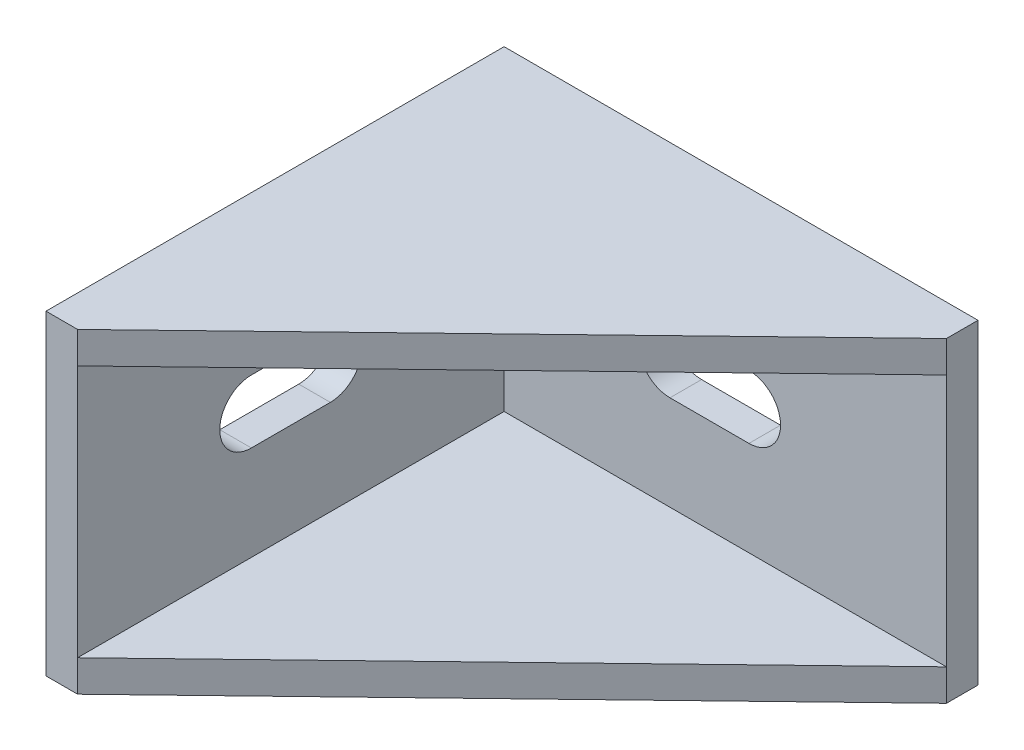
ISO-10303-21;
HEADER;
FILE_DESCRIPTION(('STEP AP214'),'2;1');
FILE_NAME('part.step','',(''),(''),'','','');
FILE_SCHEMA(('AUTOMOTIVE_DESIGN { 1 0 10303 214 1 1 1 1 }'));
ENDSEC;
DATA;
#1=APPLICATION_CONTEXT('core data for automotive mechanical design processes');
#2=APPLICATION_PROTOCOL_DEFINITION('international standard','automotive_design',2000,#1);
#3=PRODUCT_CONTEXT('',#1,'mechanical');
#4=PRODUCT('Part','Part','',(#3));
#5=PRODUCT_RELATED_PRODUCT_CATEGORY('part','',(#4));
#6=PRODUCT_DEFINITION_FORMATION('','',#4);
#7=PRODUCT_DEFINITION_CONTEXT('part definition',#1,'design');
#8=PRODUCT_DEFINITION('design','',#6,#7);
#9=PRODUCT_DEFINITION_SHAPE('','',#8);
#10=(LENGTH_UNIT() NAMED_UNIT(*) SI_UNIT(.MILLI.,.METRE.));
#11=(NAMED_UNIT(*) PLANE_ANGLE_UNIT() SI_UNIT($,.RADIAN.));
#12=(NAMED_UNIT(*) SI_UNIT($,.STERADIAN.) SOLID_ANGLE_UNIT());
#13=UNCERTAINTY_MEASURE_WITH_UNIT(LENGTH_MEASURE(1.E-05),#10,'distance_accuracy_value','');
#14=(GEOMETRIC_REPRESENTATION_CONTEXT(3) GLOBAL_UNCERTAINTY_ASSIGNED_CONTEXT((#13)) GLOBAL_UNIT_ASSIGNED_CONTEXT((#10,
#11,#12)) REPRESENTATION_CONTEXT('',''));
#15=CARTESIAN_POINT('',(0.,0.,0.));
#16=DIRECTION('',(0.,0.,1.));
#17=DIRECTION('',(1.,0.,0.));
#18=AXIS2_PLACEMENT_3D('',#15,#16,#17);
#19=CARTESIAN_POINT('',(0.,0.,0.));
#20=DIRECTION('',(0.,0.,-1.));
#21=DIRECTION('',(-1.,0.,0.));
#22=AXIS2_PLACEMENT_3D('',#19,#20,#21);
#23=PLANE('',#22);
#24=CARTESIAN_POINT('',(-2.5,0.,0.));
#25=DIRECTION('',(0.,0.,-1.));
#26=DIRECTION('',(-1.,0.,0.));
#27=AXIS2_PLACEMENT_3D('',#24,#25,#26);
#28=CIRCLE('',#27,2.);
#29=CARTESIAN_POINT('',(-2.5,-2.,0.));
#30=VERTEX_POINT('',#29);
#31=CARTESIAN_POINT('',(-2.5,2.,0.));
#32=VERTEX_POINT('',#31);
#33=EDGE_CURVE('E397',#30,#32,#28,.T.);
#34=ORIENTED_EDGE('',*,*,#33,.F.);
#35=DIRECTION('',(-1.,0.,0.));
#36=VECTOR('',#35,1.);
#37=CARTESIAN_POINT('',(0.,-2.,0.));
#38=LINE('',#37,#36);
#39=CARTESIAN_POINT('',(2.5,-2.,0.));
#40=VERTEX_POINT('',#39);
#41=EDGE_CURVE('E390',#40,#30,#38,.T.);
#42=ORIENTED_EDGE('',*,*,#41,.F.);
#43=CARTESIAN_POINT('',(2.5,0.,0.));
#44=DIRECTION('',(0.,0.,-1.));
#45=DIRECTION('',(-1.,0.,0.));
#46=AXIS2_PLACEMENT_3D('',#43,#44,#45);
#47=CIRCLE('',#46,2.);
#48=CARTESIAN_POINT('',(2.5,2.,0.));
#49=VERTEX_POINT('',#48);
#50=EDGE_CURVE('E392',#49,#40,#47,.T.);
#51=ORIENTED_EDGE('',*,*,#50,.F.);
#52=DIRECTION('',(1.,0.,0.));
#53=VECTOR('',#52,1.);
#54=CARTESIAN_POINT('',(0.,2.,0.));
#55=LINE('',#54,#53);
#56=EDGE_CURVE('E395',#32,#49,#55,.T.);
#57=ORIENTED_EDGE('',*,*,#56,.F.);
#58=EDGE_LOOP('',(#34,#42,#51,#57));
#59=FACE_BOUND('',#58,.T.);
#60=DIRECTION('',(0.,1.,0.));
#61=VECTOR('',#60,1.);
#62=CARTESIAN_POINT('',(15.,-10.,0.));
#63=LINE('',#62,#61);
#64=CARTESIAN_POINT('',(15.,-10.,0.));
#65=VERTEX_POINT('',#64);
#66=CARTESIAN_POINT('',(15.,10.,0.));
#67=VERTEX_POINT('',#66);
#68=EDGE_CURVE('E364',#65,#67,#63,.T.);
#69=ORIENTED_EDGE('',*,*,#68,.F.);
#70=DIRECTION('',(1.,0.,0.));
#71=VECTOR('',#70,1.);
#72=CARTESIAN_POINT('',(-15.,-10.,0.));
#73=LINE('',#72,#71);
#74=CARTESIAN_POINT('',(-15.,-10.,0.));
#75=VERTEX_POINT('',#74);
#76=EDGE_CURVE('E377',#75,#65,#73,.T.);
#77=ORIENTED_EDGE('',*,*,#76,.F.);
#78=DIRECTION('',(0.,-1.,0.));
#79=VECTOR('',#78,1.);
#80=CARTESIAN_POINT('',(-15.,-10.,0.));
#81=LINE('',#80,#79);
#82=CARTESIAN_POINT('',(-15.,10.,0.));
#83=VERTEX_POINT('',#82);
#84=EDGE_CURVE('E375',#83,#75,#81,.T.);
#85=ORIENTED_EDGE('',*,*,#84,.F.);
#86=DIRECTION('',(-1.,0.,0.));
#87=VECTOR('',#86,1.);
#88=CARTESIAN_POINT('',(-15.,10.,0.));
#89=LINE('',#88,#87);
#90=EDGE_CURVE('E373',#67,#83,#89,.T.);
#91=ORIENTED_EDGE('',*,*,#90,.F.);
#92=EDGE_LOOP('',(#69,#77,#85,#91));
#93=FACE_BOUND('',#92,.T.);
#94=DIRECTION('',(0.,1.,0.));
#95=VECTOR('',#94,1.);
#96=CARTESIAN_POINT('',(7.75,-1.,0.));
#97=LINE('',#96,#95);
#98=CARTESIAN_POINT('',(7.75,-1.,0.));
#99=VERTEX_POINT('',#98);
#100=CARTESIAN_POINT('',(7.75,1.,0.));
#101=VERTEX_POINT('',#100);
#102=EDGE_CURVE('E254',#99,#101,#97,.T.);
#103=ORIENTED_EDGE('',*,*,#102,.F.);
#104=CARTESIAN_POINT('',(9.75,-1.,0.));
#105=DIRECTION('',(0.,0.,-1.));
#106=DIRECTION('',(-1.,0.,0.));
#107=AXIS2_PLACEMENT_3D('',#104,#105,#106);
#108=CIRCLE('',#107,2.);
#109=CARTESIAN_POINT('',(11.75,-1.,0.));
#110=VERTEX_POINT('',#109);
#111=EDGE_CURVE('E229',#110,#99,#108,.T.);
#112=ORIENTED_EDGE('',*,*,#111,.F.);
#113=DIRECTION('',(0.,-1.,0.));
#114=VECTOR('',#113,1.);
#115=CARTESIAN_POINT('',(11.75,-1.,0.));
#116=LINE('',#115,#114);
#117=CARTESIAN_POINT('',(11.75,0.999999999999999,0.));
#118=VERTEX_POINT('',#117);
#119=EDGE_CURVE('E260',#118,#110,#116,.T.);
#120=ORIENTED_EDGE('',*,*,#119,.F.);
#121=CARTESIAN_POINT('',(9.75,1.,0.));
#122=DIRECTION('',(0.,0.,-1.));
#123=DIRECTION('',(-1.,0.,0.));
#124=AXIS2_PLACEMENT_3D('',#121,#122,#123);
#125=CIRCLE('',#124,2.);
#126=EDGE_CURVE('E257',#101,#118,#125,.T.);
#127=ORIENTED_EDGE('',*,*,#126,.F.);
#128=EDGE_LOOP('',(#103,#112,#120,#127));
#129=FACE_BOUND('',#128,.T.);
#130=DIRECTION('',(0.,1.,0.));
#131=VECTOR('',#130,1.);
#132=CARTESIAN_POINT('',(-11.75,-1.,0.));
#133=LINE('',#132,#131);
#134=CARTESIAN_POINT('',(-11.75,-1.,0.));
#135=VERTEX_POINT('',#134);
#136=CARTESIAN_POINT('',(-11.75,1.,0.));
#137=VERTEX_POINT('',#136);
#138=EDGE_CURVE('E225',#135,#137,#133,.T.);
#139=ORIENTED_EDGE('',*,*,#138,.F.);
#140=CARTESIAN_POINT('',(-9.75,-1.,0.));
#141=DIRECTION('',(0.,0.,-1.));
#142=DIRECTION('',(-1.,0.,0.));
#143=AXIS2_PLACEMENT_3D('',#140,#141,#142);
#144=CIRCLE('',#143,2.);
#145=CARTESIAN_POINT('',(-7.75,-1.,0.));
#146=VERTEX_POINT('',#145);
#147=EDGE_CURVE('E233',#146,#135,#144,.T.);
#148=ORIENTED_EDGE('',*,*,#147,.F.);
#149=DIRECTION('',(0.,-1.,0.));
#150=VECTOR('',#149,1.);
#151=CARTESIAN_POINT('',(-7.75,-1.,0.));
#152=LINE('',#151,#150);
#153=CARTESIAN_POINT('',(-7.75,1.,0.));
#154=VERTEX_POINT('',#153);
#155=EDGE_CURVE('E244',#154,#146,#152,.T.);
#156=ORIENTED_EDGE('',*,*,#155,.F.);
#157=CARTESIAN_POINT('',(-9.75,1.,0.));
#158=DIRECTION('',(0.,0.,-1.));
#159=DIRECTION('',(-1.,0.,0.));
#160=AXIS2_PLACEMENT_3D('',#157,#158,#159);
#161=CIRCLE('',#160,2.);
#162=EDGE_CURVE('E242',#137,#154,#161,.T.);
#163=ORIENTED_EDGE('',*,*,#162,.F.);
#164=EDGE_LOOP('',(#139,#148,#156,#163));
#165=FACE_BOUND('',#164,.T.);
#166=ADVANCED_FACE('F34',(#59,#93,#129,#165),#23,.T.);
#167=CARTESIAN_POINT('',(0.,0.,2.));
#168=DIRECTION('',(0.,0.,-1.));
#169=DIRECTION('',(-1.,0.,0.));
#170=AXIS2_PLACEMENT_3D('',#167,#168,#169);
#171=PLANE('',#170);
#172=DIRECTION('',(1.,0.,0.));
#173=VECTOR('',#172,1.);
#174=CARTESIAN_POINT('',(-2.5,-2.,2.));
#175=LINE('',#174,#173);
#176=CARTESIAN_POINT('',(-2.5,-2.,2.));
#177=VERTEX_POINT('',#176);
#178=CARTESIAN_POINT('',(2.5,-2.,2.));
#179=VERTEX_POINT('',#178);
#180=EDGE_CURVE('E333',#177,#179,#175,.T.);
#181=ORIENTED_EDGE('',*,*,#180,.F.);
#182=CARTESIAN_POINT('',(-2.5,0.,2.));
#183=DIRECTION('',(0.,0.,1.));
#184=DIRECTION('',(1.,0.,0.));
#185=AXIS2_PLACEMENT_3D('',#182,#183,#184);
#186=CIRCLE('',#185,2.);
#187=CARTESIAN_POINT('',(-2.5,2.,2.));
#188=VERTEX_POINT('',#187);
#189=EDGE_CURVE('E331',#188,#177,#186,.T.);
#190=ORIENTED_EDGE('',*,*,#189,.F.);
#191=DIRECTION('',(-1.,0.,0.));
#192=VECTOR('',#191,1.);
#193=CARTESIAN_POINT('',(-2.5,2.,2.));
#194=LINE('',#193,#192);
#195=CARTESIAN_POINT('',(2.5,2.,2.));
#196=VERTEX_POINT('',#195);
#197=EDGE_CURVE('E339',#196,#188,#194,.T.);
#198=ORIENTED_EDGE('',*,*,#197,.F.);
#199=CARTESIAN_POINT('',(2.5,0.,2.));
#200=DIRECTION('',(0.,0.,1.));
#201=DIRECTION('',(1.,0.,0.));
#202=AXIS2_PLACEMENT_3D('',#199,#200,#201);
#203=CIRCLE('',#202,2.);
#204=EDGE_CURVE('E336',#179,#196,#203,.T.);
#205=ORIENTED_EDGE('',*,*,#204,.F.);
#206=EDGE_LOOP('',(#181,#190,#198,#205));
#207=FACE_BOUND('',#206,.T.);
#208=DIRECTION('',(-1.,0.,0.));
#209=VECTOR('',#208,1.);
#210=CARTESIAN_POINT('',(-13.,8.,2.));
#211=LINE('',#210,#209);
#212=CARTESIAN_POINT('',(15.,8.,2.));
#213=VERTEX_POINT('',#212);
#214=CARTESIAN_POINT('',(-13.,8.,2.));
#215=VERTEX_POINT('',#214);
#216=EDGE_CURVE('E272',#213,#215,#211,.T.);
#217=ORIENTED_EDGE('',*,*,#216,.T.);
#218=DIRECTION('',(0.,-1.,0.));
#219=VECTOR('',#218,1.);
#220=CARTESIAN_POINT('',(-13.,0.,2.));
#221=LINE('',#220,#219);
#222=CARTESIAN_POINT('',(-13.,-8.,2.));
#223=VERTEX_POINT('',#222);
#224=EDGE_CURVE('E345',#215,#223,#221,.T.);
#225=ORIENTED_EDGE('',*,*,#224,.T.);
#226=DIRECTION('',(1.,0.,0.));
#227=VECTOR('',#226,1.);
#228=CARTESIAN_POINT('',(-13.,-8.,2.));
#229=LINE('',#228,#227);
#230=CARTESIAN_POINT('',(15.,-8.,2.));
#231=VERTEX_POINT('',#230);
#232=EDGE_CURVE('E289',#223,#231,#229,.T.);
#233=ORIENTED_EDGE('',*,*,#232,.T.);
#234=DIRECTION('',(0.,1.,0.));
#235=VECTOR('',#234,1.);
#236=CARTESIAN_POINT('',(15.,-10.,2.));
#237=LINE('',#236,#235);
#238=EDGE_CURVE('E370',#231,#213,#237,.T.);
#239=ORIENTED_EDGE('',*,*,#238,.T.);
#240=EDGE_LOOP('',(#217,#225,#233,#239));
#241=FACE_BOUND('',#240,.T.);
#242=ADVANCED_FACE('F477',(#207,#241),#171,.F.);
#243=CARTESIAN_POINT('',(-13.,0.,29.));
#244=DIRECTION('',(1.,0.,0.));
#245=DIRECTION('',(0.,1.,0.));
#246=AXIS2_PLACEMENT_3D('',#243,#244,#245);
#247=PLANE('',#246);
#248=CARTESIAN_POINT('',(-13.,0.,18.));
#249=DIRECTION('',(1.,0.,0.));
#250=DIRECTION('',(0.,1.,0.));
#251=AXIS2_PLACEMENT_3D('',#248,#249,#250);
#252=CIRCLE('',#251,2.);
#253=CARTESIAN_POINT('',(-13.,2.,18.));
#254=VERTEX_POINT('',#253);
#255=CARTESIAN_POINT('',(-13.,-2.,18.));
#256=VERTEX_POINT('',#255);
#257=EDGE_CURVE('E299',#254,#256,#252,.T.);
#258=ORIENTED_EDGE('',*,*,#257,.F.);
#259=DIRECTION('',(0.,0.,1.));
#260=VECTOR('',#259,1.);
#261=CARTESIAN_POINT('',(-13.,2.,18.));
#262=LINE('',#261,#260);
#263=CARTESIAN_POINT('',(-13.,2.,13.));
#264=VERTEX_POINT('',#263);
#265=EDGE_CURVE('E307',#264,#254,#262,.T.);
#266=ORIENTED_EDGE('',*,*,#265,.F.);
#267=CARTESIAN_POINT('',(-13.,0.,13.));
#268=DIRECTION('',(1.,0.,0.));
#269=DIRECTION('',(0.,1.,0.));
#270=AXIS2_PLACEMENT_3D('',#267,#268,#269);
#271=CIRCLE('',#270,2.);
#272=CARTESIAN_POINT('',(-13.,-2.,13.));
#273=VERTEX_POINT('',#272);
#274=EDGE_CURVE('E304',#273,#264,#271,.T.);
#275=ORIENTED_EDGE('',*,*,#274,.F.);
#276=DIRECTION('',(0.,0.,-1.));
#277=VECTOR('',#276,1.);
#278=CARTESIAN_POINT('',(-13.,-2.,18.));
#279=LINE('',#278,#277);
#280=EDGE_CURVE('E301',#256,#273,#279,.T.);
#281=ORIENTED_EDGE('',*,*,#280,.F.);
#282=EDGE_LOOP('',(#258,#266,#275,#281));
#283=FACE_BOUND('',#282,.T.);
#284=ORIENTED_EDGE('',*,*,#224,.F.);
#285=DIRECTION('',(0.,0.,1.));
#286=VECTOR('',#285,1.);
#287=CARTESIAN_POINT('',(-13.,8.,29.));
#288=LINE('',#287,#286);
#289=CARTESIAN_POINT('',(-13.,8.,29.));
#290=VERTEX_POINT('',#289);
#291=EDGE_CURVE('E274',#215,#290,#288,.T.);
#292=ORIENTED_EDGE('',*,*,#291,.T.);
#293=DIRECTION('',(0.,-1.,0.));
#294=VECTOR('',#293,1.);
#295=CARTESIAN_POINT('',(-13.,0.,29.));
#296=LINE('',#295,#294);
#297=CARTESIAN_POINT('',(-13.,-8.,29.));
#298=VERTEX_POINT('',#297);
#299=EDGE_CURVE('E356',#290,#298,#296,.T.);
#300=ORIENTED_EDGE('',*,*,#299,.T.);
#301=DIRECTION('',(0.,0.,-1.));
#302=VECTOR('',#301,1.);
#303=CARTESIAN_POINT('',(-13.,-8.,29.));
#304=LINE('',#303,#302);
#305=EDGE_CURVE('E286',#298,#223,#304,.T.);
#306=ORIENTED_EDGE('',*,*,#305,.T.);
#307=EDGE_LOOP('',(#284,#292,#300,#306));
#308=FACE_BOUND('',#307,.T.);
#309=ADVANCED_FACE('F483',(#283,#308),#247,.T.);
#310=CARTESIAN_POINT('',(15.,-10.,2.));
#311=DIRECTION('',(-1.,0.,0.));
#312=DIRECTION('',(0.,0.,1.));
#313=AXIS2_PLACEMENT_3D('',#310,#311,#312);
#314=PLANE('',#313);
#315=ORIENTED_EDGE('',*,*,#68,.T.);
#316=DIRECTION('',(0.,0.,-1.));
#317=VECTOR('',#316,1.);
#318=CARTESIAN_POINT('',(15.,10.,2.));
#319=LINE('',#318,#317);
#320=CARTESIAN_POINT('',(15.,10.,2.));
#321=VERTEX_POINT('',#320);
#322=EDGE_CURVE('E387',#321,#67,#319,.T.);
#323=ORIENTED_EDGE('',*,*,#322,.F.);
#324=DIRECTION('',(0.,1.,0.));
#325=VECTOR('',#324,1.);
#326=CARTESIAN_POINT('',(15.,8.,2.));
#327=LINE('',#326,#325);
#328=EDGE_CURVE('E280',#213,#321,#327,.T.);
#329=ORIENTED_EDGE('',*,*,#328,.F.);
#330=ORIENTED_EDGE('',*,*,#238,.F.);
#331=CARTESIAN_POINT('',(15.,-10.,2.));
#332=VERTEX_POINT('',#331);
#333=EDGE_CURVE('E366',#332,#231,#237,.T.);
#334=ORIENTED_EDGE('',*,*,#333,.F.);
#335=DIRECTION('',(0.,0.,-1.));
#336=VECTOR('',#335,1.);
#337=CARTESIAN_POINT('',(15.,-10.,2.));
#338=LINE('',#337,#336);
#339=EDGE_CURVE('E369',#332,#65,#338,.T.);
#340=ORIENTED_EDGE('',*,*,#339,.T.);
#341=EDGE_LOOP('',(#315,#323,#329,#330,#334,#340));
#342=FACE_BOUND('',#341,.T.);
#343=ADVANCED_FACE('F502',(#342),#314,.F.);
#344=CARTESIAN_POINT('',(-15.,10.,2.));
#345=DIRECTION('',(0.,-1.,0.));
#346=DIRECTION('',(0.,0.,-1.));
#347=AXIS2_PLACEMENT_3D('',#344,#345,#346);
#348=PLANE('',#347);
#349=ORIENTED_EDGE('',*,*,#90,.T.);
#350=DIRECTION('',(0.,0.,-1.));
#351=VECTOR('',#350,1.);
#352=CARTESIAN_POINT('',(-15.,10.,2.));
#353=LINE('',#352,#351);
#354=CARTESIAN_POINT('',(-15.,10.,29.));
#355=VERTEX_POINT('',#354);
#356=EDGE_CURVE('E384',#355,#83,#353,.T.);
#357=ORIENTED_EDGE('',*,*,#356,.F.);
#358=DIRECTION('',(-1.,0.,0.));
#359=VECTOR('',#358,1.);
#360=CARTESIAN_POINT('',(0.,10.,29.));
#361=LINE('',#360,#359);
#362=CARTESIAN_POINT('',(-13.,10.,29.));
#363=VERTEX_POINT('',#362);
#364=EDGE_CURVE('E355',#363,#355,#361,.T.);
#365=ORIENTED_EDGE('',*,*,#364,.F.);
#366=DIRECTION('',(0.719844295420685,0.,-0.694135570584232));
#367=VECTOR('',#366,1.);
#368=CARTESIAN_POINT('',(15.,10.,2.));
#369=LINE('',#368,#367);
#370=EDGE_CURVE('E271',#363,#321,#369,.T.);
#371=ORIENTED_EDGE('',*,*,#370,.T.);
#372=ORIENTED_EDGE('',*,*,#322,.T.);
#373=EDGE_LOOP('',(#349,#357,#365,#371,#372));
#374=FACE_BOUND('',#373,.T.);
#375=ADVANCED_FACE('F498',(#374),#348,.F.);
#376=CARTESIAN_POINT('',(-15.,-10.,2.));
#377=DIRECTION('',(1.,0.,0.));
#378=DIRECTION('',(0.,0.,-1.));
#379=AXIS2_PLACEMENT_3D('',#376,#377,#378);
#380=PLANE('',#379);
#381=DIRECTION('',(0.,0.,1.));
#382=VECTOR('',#381,1.);
#383=CARTESIAN_POINT('',(-15.,2.,2.));
#384=LINE('',#383,#382);
#385=CARTESIAN_POINT('',(-15.,2.,13.));
#386=VERTEX_POINT('',#385);
#387=CARTESIAN_POINT('',(-15.,2.,18.));
#388=VERTEX_POINT('',#387);
#389=EDGE_CURVE('E325',#386,#388,#384,.T.);
#390=ORIENTED_EDGE('',*,*,#389,.T.);
#391=CARTESIAN_POINT('',(-15.,0.,18.));
#392=DIRECTION('',(1.,0.,0.));
#393=DIRECTION('',(0.,0.,-1.));
#394=AXIS2_PLACEMENT_3D('',#391,#392,#393);
#395=CIRCLE('',#394,2.);
#396=CARTESIAN_POINT('',(-15.,-2.,18.));
#397=VERTEX_POINT('',#396);
#398=EDGE_CURVE('E328',#388,#397,#395,.T.);
#399=ORIENTED_EDGE('',*,*,#398,.T.);
#400=DIRECTION('',(0.,0.,-1.));
#401=VECTOR('',#400,1.);
#402=CARTESIAN_POINT('',(-15.,-2.,2.));
#403=LINE('',#402,#401);
#404=CARTESIAN_POINT('',(-15.,-2.,13.));
#405=VERTEX_POINT('',#404);
#406=EDGE_CURVE('E313',#397,#405,#403,.T.);
#407=ORIENTED_EDGE('',*,*,#406,.T.);
#408=CARTESIAN_POINT('',(-15.,0.,13.));
#409=DIRECTION('',(1.,0.,0.));
#410=DIRECTION('',(0.,0.,-1.));
#411=AXIS2_PLACEMENT_3D('',#408,#409,#410);
#412=CIRCLE('',#411,2.);
#413=EDGE_CURVE('E322',#405,#386,#412,.T.);
#414=ORIENTED_EDGE('',*,*,#413,.T.);
#415=EDGE_LOOP('',(#390,#399,#407,#414));
#416=FACE_BOUND('',#415,.T.);
#417=ORIENTED_EDGE('',*,*,#84,.T.);
#418=DIRECTION('',(0.,0.,-1.));
#419=VECTOR('',#418,1.);
#420=CARTESIAN_POINT('',(-15.,-10.,2.));
#421=LINE('',#420,#419);
#422=CARTESIAN_POINT('',(-15.,-10.,29.));
#423=VERTEX_POINT('',#422);
#424=EDGE_CURVE('E381',#423,#75,#421,.T.);
#425=ORIENTED_EDGE('',*,*,#424,.F.);
#426=DIRECTION('',(0.,-1.,0.));
#427=VECTOR('',#426,1.);
#428=CARTESIAN_POINT('',(-15.,0.,29.));
#429=LINE('',#428,#427);
#430=EDGE_CURVE('E359',#355,#423,#429,.T.);
#431=ORIENTED_EDGE('',*,*,#430,.F.);
#432=ORIENTED_EDGE('',*,*,#356,.T.);
#433=EDGE_LOOP('',(#417,#425,#431,#432));
#434=FACE_BOUND('',#433,.T.);
#435=ADVANCED_FACE('F494',(#416,#434),#380,.F.);
#436=CARTESIAN_POINT('',(-15.,-10.,2.));
#437=DIRECTION('',(0.,1.,0.));
#438=DIRECTION('',(0.,0.,1.));
#439=AXIS2_PLACEMENT_3D('',#436,#437,#438);
#440=PLANE('',#439);
#441=ORIENTED_EDGE('',*,*,#339,.F.);
#442=DIRECTION('',(-0.719844295420685,0.,0.694135570584232));
#443=VECTOR('',#442,1.);
#444=CARTESIAN_POINT('',(-13.,-10.,29.));
#445=LINE('',#444,#443);
#446=CARTESIAN_POINT('',(-13.,-10.,29.));
#447=VERTEX_POINT('',#446);
#448=EDGE_CURVE('E285',#332,#447,#445,.T.);
#449=ORIENTED_EDGE('',*,*,#448,.T.);
#450=DIRECTION('',(1.,0.,0.));
#451=VECTOR('',#450,1.);
#452=CARTESIAN_POINT('',(0.,-10.,29.));
#453=LINE('',#452,#451);
#454=EDGE_CURVE('E362',#423,#447,#453,.T.);
#455=ORIENTED_EDGE('',*,*,#454,.F.);
#456=ORIENTED_EDGE('',*,*,#424,.T.);
#457=ORIENTED_EDGE('',*,*,#76,.T.);
#458=EDGE_LOOP('',(#441,#449,#455,#456,#457));
#459=FACE_BOUND('',#458,.T.);
#460=ADVANCED_FACE('F490',(#459),#440,.F.);
#461=CARTESIAN_POINT('',(0.,0.,29.));
#462=DIRECTION('',(0.,0.,1.));
#463=DIRECTION('',(1.,0.,0.));
#464=AXIS2_PLACEMENT_3D('',#461,#462,#463);
#465=PLANE('',#464);
#466=EDGE_CURVE('E352',#363,#290,#296,.T.);
#467=ORIENTED_EDGE('',*,*,#466,.F.);
#468=ORIENTED_EDGE('',*,*,#364,.T.);
#469=ORIENTED_EDGE('',*,*,#430,.T.);
#470=ORIENTED_EDGE('',*,*,#454,.T.);
#471=DIRECTION('',(0.,-1.,0.));
#472=VECTOR('',#471,1.);
#473=CARTESIAN_POINT('',(-13.,-8.,29.));
#474=LINE('',#473,#472);
#475=EDGE_CURVE('E294',#298,#447,#474,.T.);
#476=ORIENTED_EDGE('',*,*,#475,.F.);
#477=ORIENTED_EDGE('',*,*,#299,.F.);
#478=EDGE_LOOP('',(#467,#468,#469,#470,#476,#477));
#479=FACE_BOUND('',#478,.T.);
#480=ADVANCED_FACE('F493',(#479),#465,.T.);
#481=CARTESIAN_POINT('',(-2.5,0.,-25.));
#482=DIRECTION('',(0.,0.,1.));
#483=DIRECTION('',(1.,0.,0.));
#484=AXIS2_PLACEMENT_3D('',#481,#482,#483);
#485=CYLINDRICAL_SURFACE('',#484,2.);
#486=ORIENTED_EDGE('',*,*,#33,.T.);
#487=DIRECTION('',(0.,0.,1.));
#488=VECTOR('',#487,1.);
#489=CARTESIAN_POINT('',(-2.5,2.,-25.));
#490=LINE('',#489,#488);
#491=EDGE_CURVE('E343',#32,#188,#490,.T.);
#492=ORIENTED_EDGE('',*,*,#491,.T.);
#493=ORIENTED_EDGE('',*,*,#189,.T.);
#494=DIRECTION('',(0.,0.,1.));
#495=VECTOR('',#494,1.);
#496=CARTESIAN_POINT('',(-2.5,-2.,-25.));
#497=LINE('',#496,#495);
#498=EDGE_CURVE('E342',#30,#177,#497,.T.);
#499=ORIENTED_EDGE('',*,*,#498,.F.);
#500=EDGE_LOOP('',(#486,#492,#493,#499));
#501=FACE_BOUND('',#500,.T.);
#502=ADVANCED_FACE('F633',(#501),#485,.F.);
#503=CARTESIAN_POINT('',(-2.5,2.,-25.));
#504=DIRECTION('',(0.,1.,0.));
#505=DIRECTION('',(0.,0.,1.));
#506=AXIS2_PLACEMENT_3D('',#503,#504,#505);
#507=PLANE('',#506);
#508=ORIENTED_EDGE('',*,*,#56,.T.);
#509=DIRECTION('',(0.,0.,1.));
#510=VECTOR('',#509,1.);
#511=CARTESIAN_POINT('',(2.5,2.,-25.));
#512=LINE('',#511,#510);
#513=EDGE_CURVE('E346',#49,#196,#512,.T.);
#514=ORIENTED_EDGE('',*,*,#513,.T.);
#515=ORIENTED_EDGE('',*,*,#197,.T.);
#516=ORIENTED_EDGE('',*,*,#491,.F.);
#517=EDGE_LOOP('',(#508,#514,#515,#516));
#518=FACE_BOUND('',#517,.T.);
#519=ADVANCED_FACE('F756',(#518),#507,.F.);
#520=CARTESIAN_POINT('',(2.5,0.,-25.));
#521=DIRECTION('',(0.,0.,1.));
#522=DIRECTION('',(1.,0.,0.));
#523=AXIS2_PLACEMENT_3D('',#520,#521,#522);
#524=CYLINDRICAL_SURFACE('',#523,2.);
#525=ORIENTED_EDGE('',*,*,#50,.T.);
#526=DIRECTION('',(0.,0.,1.));
#527=VECTOR('',#526,1.);
#528=CARTESIAN_POINT('',(2.5,-2.,-25.));
#529=LINE('',#528,#527);
#530=EDGE_CURVE('E348',#40,#179,#529,.T.);
#531=ORIENTED_EDGE('',*,*,#530,.T.);
#532=ORIENTED_EDGE('',*,*,#204,.T.);
#533=ORIENTED_EDGE('',*,*,#513,.F.);
#534=EDGE_LOOP('',(#525,#531,#532,#533));
#535=FACE_BOUND('',#534,.T.);
#536=ADVANCED_FACE('F746',(#535),#524,.F.);
#537=CARTESIAN_POINT('',(-2.5,-2.,-25.));
#538=DIRECTION('',(0.,-1.,0.));
#539=DIRECTION('',(0.,0.,-1.));
#540=AXIS2_PLACEMENT_3D('',#537,#538,#539);
#541=PLANE('',#540);
#542=ORIENTED_EDGE('',*,*,#41,.T.);
#543=ORIENTED_EDGE('',*,*,#498,.T.);
#544=ORIENTED_EDGE('',*,*,#180,.T.);
#545=ORIENTED_EDGE('',*,*,#530,.F.);
#546=EDGE_LOOP('',(#542,#543,#544,#545));
#547=FACE_BOUND('',#546,.T.);
#548=ADVANCED_FACE('F728',(#547),#541,.F.);
#549=CARTESIAN_POINT('',(-40.,0.,18.));
#550=DIRECTION('',(1.,0.,0.));
#551=DIRECTION('',(0.,1.,0.));
#552=AXIS2_PLACEMENT_3D('',#549,#550,#551);
#553=CYLINDRICAL_SURFACE('',#552,2.);
#554=DIRECTION('',(1.,0.,0.));
#555=VECTOR('',#554,1.);
#556=CARTESIAN_POINT('',(-40.,1.99999999999999,18.));
#557=LINE('',#556,#555);
#558=EDGE_CURVE('E311',#388,#254,#557,.T.);
#559=ORIENTED_EDGE('',*,*,#558,.T.);
#560=ORIENTED_EDGE('',*,*,#257,.T.);
#561=DIRECTION('',(1.,0.,0.));
#562=VECTOR('',#561,1.);
#563=CARTESIAN_POINT('',(-40.,-2.00000000000001,18.));
#564=LINE('',#563,#562);
#565=EDGE_CURVE('E310',#397,#256,#564,.T.);
#566=ORIENTED_EDGE('',*,*,#565,.F.);
#567=ORIENTED_EDGE('',*,*,#398,.F.);
#568=EDGE_LOOP('',(#559,#560,#566,#567));
#569=FACE_BOUND('',#568,.T.);
#570=ADVANCED_FACE('F718',(#569),#553,.F.);
#571=CARTESIAN_POINT('',(-40.,1.99999999999999,18.));
#572=DIRECTION('',(0.,1.,0.));
#573=DIRECTION('',(0.,0.,1.));
#574=AXIS2_PLACEMENT_3D('',#571,#572,#573);
#575=PLANE('',#574);
#576=DIRECTION('',(1.,0.,0.));
#577=VECTOR('',#576,1.);
#578=CARTESIAN_POINT('',(-40.,1.99999999999999,13.));
#579=LINE('',#578,#577);
#580=EDGE_CURVE('E314',#386,#264,#579,.T.);
#581=ORIENTED_EDGE('',*,*,#580,.T.);
#582=ORIENTED_EDGE('',*,*,#265,.T.);
#583=ORIENTED_EDGE('',*,*,#558,.F.);
#584=ORIENTED_EDGE('',*,*,#389,.F.);
#585=EDGE_LOOP('',(#581,#582,#583,#584));
#586=FACE_BOUND('',#585,.T.);
#587=ADVANCED_FACE('F708',(#586),#575,.F.);
#588=CARTESIAN_POINT('',(-40.,0.,13.));
#589=DIRECTION('',(1.,0.,0.));
#590=DIRECTION('',(0.,1.,0.));
#591=AXIS2_PLACEMENT_3D('',#588,#589,#590);
#592=CYLINDRICAL_SURFACE('',#591,2.);
#593=DIRECTION('',(1.,0.,0.));
#594=VECTOR('',#593,1.);
#595=CARTESIAN_POINT('',(-40.,-2.00000000000001,13.));
#596=LINE('',#595,#594);
#597=EDGE_CURVE('E316',#405,#273,#596,.T.);
#598=ORIENTED_EDGE('',*,*,#597,.T.);
#599=ORIENTED_EDGE('',*,*,#274,.T.);
#600=ORIENTED_EDGE('',*,*,#580,.F.);
#601=ORIENTED_EDGE('',*,*,#413,.F.);
#602=EDGE_LOOP('',(#598,#599,#600,#601));
#603=FACE_BOUND('',#602,.T.);
#604=ADVANCED_FACE('F698',(#603),#592,.F.);
#605=CARTESIAN_POINT('',(-40.,-2.00000000000001,18.));
#606=DIRECTION('',(0.,-1.,0.));
#607=DIRECTION('',(0.,0.,-1.));
#608=AXIS2_PLACEMENT_3D('',#605,#606,#607);
#609=PLANE('',#608);
#610=ORIENTED_EDGE('',*,*,#565,.T.);
#611=ORIENTED_EDGE('',*,*,#280,.T.);
#612=ORIENTED_EDGE('',*,*,#597,.F.);
#613=ORIENTED_EDGE('',*,*,#406,.F.);
#614=EDGE_LOOP('',(#610,#611,#612,#613));
#615=FACE_BOUND('',#614,.T.);
#616=ADVANCED_FACE('F682',(#615),#609,.F.);
#617=CARTESIAN_POINT('',(-13.,-8.,29.));
#618=DIRECTION('',(0.694135570584232,0.,0.719844295420685));
#619=DIRECTION('',(0.719844295420685,0.,-0.694135570584232));
#620=AXIS2_PLACEMENT_3D('',#617,#618,#619);
#621=PLANE('',#620);
#622=ORIENTED_EDGE('',*,*,#448,.F.);
#623=ORIENTED_EDGE('',*,*,#333,.T.);
#624=DIRECTION('',(-0.719844295420685,0.,0.694135570584232));
#625=VECTOR('',#624,1.);
#626=CARTESIAN_POINT('',(-13.,-8.,29.));
#627=LINE('',#626,#625);
#628=EDGE_CURVE('E291',#231,#298,#627,.T.);
#629=ORIENTED_EDGE('',*,*,#628,.T.);
#630=ORIENTED_EDGE('',*,*,#475,.T.);
#631=EDGE_LOOP('',(#622,#623,#629,#630));
#632=FACE_BOUND('',#631,.T.);
#633=ADVANCED_FACE('F672',(#632),#621,.T.);
#634=CARTESIAN_POINT('',(0.,-8.,0.));
#635=DIRECTION('',(0.,-1.,0.));
#636=DIRECTION('',(0.,0.,-1.));
#637=AXIS2_PLACEMENT_3D('',#634,#635,#636);
#638=PLANE('',#637);
#639=ORIENTED_EDGE('',*,*,#305,.F.);
#640=ORIENTED_EDGE('',*,*,#628,.F.);
#641=ORIENTED_EDGE('',*,*,#232,.F.);
#642=EDGE_LOOP('',(#639,#640,#641));
#643=FACE_BOUND('',#642,.T.);
#644=ADVANCED_FACE('F621',(#643),#638,.F.);
#645=CARTESIAN_POINT('',(15.,8.,2.));
#646=DIRECTION('',(0.694135570584232,0.,0.719844295420685));
#647=DIRECTION('',(0.719844295420685,0.,-0.694135570584232));
#648=AXIS2_PLACEMENT_3D('',#645,#646,#647);
#649=PLANE('',#648);
#650=ORIENTED_EDGE('',*,*,#370,.F.);
#651=ORIENTED_EDGE('',*,*,#466,.T.);
#652=DIRECTION('',(0.719844295420685,0.,-0.694135570584232));
#653=VECTOR('',#652,1.);
#654=CARTESIAN_POINT('',(15.,8.,2.));
#655=LINE('',#654,#653);
#656=EDGE_CURVE('E277',#290,#213,#655,.T.);
#657=ORIENTED_EDGE('',*,*,#656,.T.);
#658=ORIENTED_EDGE('',*,*,#328,.T.);
#659=EDGE_LOOP('',(#650,#651,#657,#658));
#660=FACE_BOUND('',#659,.T.);
#661=ADVANCED_FACE('F611',(#660),#649,.T.);
#662=CARTESIAN_POINT('',(0.,8.,0.));
#663=DIRECTION('',(0.,1.,0.));
#664=DIRECTION('',(0.,0.,1.));
#665=AXIS2_PLACEMENT_3D('',#662,#663,#664);
#666=PLANE('',#665);
#667=ORIENTED_EDGE('',*,*,#216,.F.);
#668=ORIENTED_EDGE('',*,*,#656,.F.);
#669=ORIENTED_EDGE('',*,*,#291,.F.);
#670=EDGE_LOOP('',(#667,#668,#669));
#671=FACE_BOUND('',#670,.T.);
#672=ADVANCED_FACE('F596',(#671),#666,.F.);
#673=CARTESIAN_POINT('',(9.75,-1.,-3.));
#674=DIRECTION('',(0.,0.,1.));
#675=DIRECTION('',(1.,0.,0.));
#676=AXIS2_PLACEMENT_3D('',#673,#674,#675);
#677=CYLINDRICAL_SURFACE('',#676,2.);
#678=DIRECTION('',(0.,0.,1.));
#679=VECTOR('',#678,1.);
#680=CARTESIAN_POINT('',(7.75,-1.,-3.));
#681=LINE('',#680,#679);
#682=CARTESIAN_POINT('',(7.75,-1.,-2.5));
#683=VERTEX_POINT('',#682);
#684=EDGE_CURVE('E269',#683,#99,#681,.T.);
#685=ORIENTED_EDGE('',*,*,#684,.F.);
#686=CARTESIAN_POINT('',(9.75,-1.,-2.5));
#687=DIRECTION('',(0.,0.,-1.));
#688=DIRECTION('',(-1.,0.,0.));
#689=AXIS2_PLACEMENT_3D('',#686,#687,#688);
#690=CIRCLE('',#689,2.);
#691=CARTESIAN_POINT('',(11.75,-1.,-2.5));
#692=VERTEX_POINT('',#691);
#693=EDGE_CURVE('E411',#683,#692,#690,.F.);
#694=ORIENTED_EDGE('',*,*,#693,.T.);
#695=DIRECTION('',(0.,0.,1.));
#696=VECTOR('',#695,1.);
#697=CARTESIAN_POINT('',(11.75,-1.,-3.));
#698=LINE('',#697,#696);
#699=EDGE_CURVE('E263',#692,#110,#698,.T.);
#700=ORIENTED_EDGE('',*,*,#699,.T.);
#701=ORIENTED_EDGE('',*,*,#111,.T.);
#702=EDGE_LOOP('',(#685,#694,#700,#701));
#703=FACE_BOUND('',#702,.T.);
#704=ADVANCED_FACE('F587',(#703),#677,.T.);
#705=CARTESIAN_POINT('',(7.75,-1.,-3.));
#706=DIRECTION('',(1.,0.,0.));
#707=DIRECTION('',(0.,0.,-1.));
#708=AXIS2_PLACEMENT_3D('',#705,#706,#707);
#709=PLANE('',#708);
#710=DIRECTION('',(0.,0.,1.));
#711=VECTOR('',#710,1.);
#712=CARTESIAN_POINT('',(7.75,1.,-3.));
#713=LINE('',#712,#711);
#714=CARTESIAN_POINT('',(7.75,1.,-2.5));
#715=VERTEX_POINT('',#714);
#716=EDGE_CURVE('E267',#715,#101,#713,.T.);
#717=ORIENTED_EDGE('',*,*,#716,.F.);
#718=DIRECTION('',(0.,1.,0.));
#719=VECTOR('',#718,1.);
#720=CARTESIAN_POINT('',(7.75,-1.,-2.5));
#721=LINE('',#720,#719);
#722=EDGE_CURVE('E408',#715,#683,#721,.F.);
#723=ORIENTED_EDGE('',*,*,#722,.T.);
#724=ORIENTED_EDGE('',*,*,#684,.T.);
#725=ORIENTED_EDGE('',*,*,#102,.T.);
#726=EDGE_LOOP('',(#717,#723,#724,#725));
#727=FACE_BOUND('',#726,.T.);
#728=ADVANCED_FACE('F577',(#727),#709,.F.);
#729=CARTESIAN_POINT('',(9.75,1.,-3.));
#730=DIRECTION('',(0.,0.,1.));
#731=DIRECTION('',(1.,0.,0.));
#732=AXIS2_PLACEMENT_3D('',#729,#730,#731);
#733=CYLINDRICAL_SURFACE('',#732,2.);
#734=DIRECTION('',(0.,0.,1.));
#735=VECTOR('',#734,1.);
#736=CARTESIAN_POINT('',(11.75,0.999999999999999,-3.));
#737=LINE('',#736,#735);
#738=CARTESIAN_POINT('',(11.75,0.999999999999999,-2.5));
#739=VERTEX_POINT('',#738);
#740=EDGE_CURVE('E265',#739,#118,#737,.T.);
#741=ORIENTED_EDGE('',*,*,#740,.F.);
#742=CARTESIAN_POINT('',(9.75,1.,-2.5));
#743=DIRECTION('',(0.,0.,-1.));
#744=DIRECTION('',(-1.,0.,0.));
#745=AXIS2_PLACEMENT_3D('',#742,#743,#744);
#746=CIRCLE('',#745,2.);
#747=EDGE_CURVE('E415',#739,#715,#746,.F.);
#748=ORIENTED_EDGE('',*,*,#747,.T.);
#749=ORIENTED_EDGE('',*,*,#716,.T.);
#750=ORIENTED_EDGE('',*,*,#126,.T.);
#751=EDGE_LOOP('',(#741,#748,#749,#750));
#752=FACE_BOUND('',#751,.T.);
#753=ADVANCED_FACE('F567',(#752),#733,.T.);
#754=CARTESIAN_POINT('',(11.75,-1.,-3.));
#755=DIRECTION('',(-1.,0.,0.));
#756=DIRECTION('',(0.,0.,1.));
#757=AXIS2_PLACEMENT_3D('',#754,#755,#756);
#758=PLANE('',#757);
#759=ORIENTED_EDGE('',*,*,#699,.F.);
#760=DIRECTION('',(0.,-1.,0.));
#761=VECTOR('',#760,1.);
#762=CARTESIAN_POINT('',(11.75,0.999999999999998,-2.5));
#763=LINE('',#762,#761);
#764=EDGE_CURVE('E413',#692,#739,#763,.F.);
#765=ORIENTED_EDGE('',*,*,#764,.T.);
#766=ORIENTED_EDGE('',*,*,#740,.T.);
#767=ORIENTED_EDGE('',*,*,#119,.T.);
#768=EDGE_LOOP('',(#759,#765,#766,#767));
#769=FACE_BOUND('',#768,.T.);
#770=ADVANCED_FACE('F555',(#769),#758,.F.);
#771=CARTESIAN_POINT('',(9.75,-1.,-3.));
#772=DIRECTION('',(0.,0.,-1.));
#773=DIRECTION('',(-1.,0.,0.));
#774=AXIS2_PLACEMENT_3D('',#771,#772,#773);
#775=PLANE('',#774);
#776=CARTESIAN_POINT('',(9.75,-1.,-3.));
#777=DIRECTION('',(0.,0.,-1.));
#778=DIRECTION('',(-1.,0.,0.));
#779=AXIS2_PLACEMENT_3D('',#776,#777,#778);
#780=CIRCLE('',#779,1.5);
#781=CARTESIAN_POINT('',(11.25,-1.,-3.));
#782=VERTEX_POINT('',#781);
#783=CARTESIAN_POINT('',(8.25,-1.,-3.));
#784=VERTEX_POINT('',#783);
#785=EDGE_CURVE('E403',#782,#784,#780,.T.);
#786=ORIENTED_EDGE('',*,*,#785,.T.);
#787=DIRECTION('',(0.,1.,0.));
#788=VECTOR('',#787,1.);
#789=CARTESIAN_POINT('',(8.25,1.,-3.));
#790=LINE('',#789,#788);
#791=CARTESIAN_POINT('',(8.25,1.,-3.));
#792=VERTEX_POINT('',#791);
#793=EDGE_CURVE('E405',#784,#792,#790,.T.);
#794=ORIENTED_EDGE('',*,*,#793,.T.);
#795=CARTESIAN_POINT('',(9.75,1.,-3.));
#796=DIRECTION('',(0.,0.,-1.));
#797=DIRECTION('',(-1.,0.,0.));
#798=AXIS2_PLACEMENT_3D('',#795,#796,#797);
#799=CIRCLE('',#798,1.5);
#800=CARTESIAN_POINT('',(11.25,0.999999999999999,-3.));
#801=VERTEX_POINT('',#800);
#802=EDGE_CURVE('E399',#792,#801,#799,.T.);
#803=ORIENTED_EDGE('',*,*,#802,.T.);
#804=DIRECTION('',(0.,-1.,0.));
#805=VECTOR('',#804,1.);
#806=CARTESIAN_POINT('',(11.25,-1.,-3.));
#807=LINE('',#806,#805);
#808=EDGE_CURVE('E401',#801,#782,#807,.T.);
#809=ORIENTED_EDGE('',*,*,#808,.T.);
#810=EDGE_LOOP('',(#786,#794,#803,#809));
#811=FACE_BOUND('',#810,.T.);
#812=ADVANCED_FACE('F550',(#811),#775,.T.);
#813=CARTESIAN_POINT('',(-9.75,-1.,-3.));
#814=DIRECTION('',(0.,0.,1.));
#815=DIRECTION('',(1.,0.,0.));
#816=AXIS2_PLACEMENT_3D('',#813,#814,#815);
#817=CYLINDRICAL_SURFACE('',#816,2.);
#818=DIRECTION('',(0.,0.,1.));
#819=VECTOR('',#818,1.);
#820=CARTESIAN_POINT('',(-11.75,-1.,-3.));
#821=LINE('',#820,#819);
#822=CARTESIAN_POINT('',(-11.75,-1.,-2.5));
#823=VERTEX_POINT('',#822);
#824=EDGE_CURVE('E220',#823,#135,#821,.T.);
#825=ORIENTED_EDGE('',*,*,#824,.F.);
#826=CARTESIAN_POINT('',(-9.75,-1.,-2.5));
#827=DIRECTION('',(0.,0.,-1.));
#828=DIRECTION('',(-1.,0.,0.));
#829=AXIS2_PLACEMENT_3D('',#826,#827,#828);
#830=CIRCLE('',#829,2.);
#831=CARTESIAN_POINT('',(-7.75,-1.,-2.5));
#832=VERTEX_POINT('',#831);
#833=EDGE_CURVE('E58',#823,#832,#830,.F.);
#834=ORIENTED_EDGE('',*,*,#833,.T.);
#835=DIRECTION('',(0.,0.,1.));
#836=VECTOR('',#835,1.);
#837=CARTESIAN_POINT('',(-7.75,-1.,-3.));
#838=LINE('',#837,#836);
#839=EDGE_CURVE('E235',#832,#146,#838,.T.);
#840=ORIENTED_EDGE('',*,*,#839,.T.);
#841=ORIENTED_EDGE('',*,*,#147,.T.);
#842=EDGE_LOOP('',(#825,#834,#840,#841));
#843=FACE_BOUND('',#842,.T.);
#844=ADVANCED_FACE('F234',(#843),#817,.T.);
#845=CARTESIAN_POINT('',(-11.75,-1.,-3.));
#846=DIRECTION('',(1.,0.,0.));
#847=DIRECTION('',(0.,0.,-1.));
#848=AXIS2_PLACEMENT_3D('',#845,#846,#847);
#849=PLANE('',#848);
#850=DIRECTION('',(0.,0.,1.));
#851=VECTOR('',#850,1.);
#852=CARTESIAN_POINT('',(-11.75,1.,-3.));
#853=LINE('',#852,#851);
#854=CARTESIAN_POINT('',(-11.75,1.,-2.5));
#855=VERTEX_POINT('',#854);
#856=EDGE_CURVE('E230',#855,#137,#853,.T.);
#857=ORIENTED_EDGE('',*,*,#856,.F.);
#858=DIRECTION('',(0.,1.,0.));
#859=VECTOR('',#858,1.);
#860=CARTESIAN_POINT('',(-11.75,-1.,-2.5));
#861=LINE('',#860,#859);
#862=EDGE_CURVE('E228',#855,#823,#861,.F.);
#863=ORIENTED_EDGE('',*,*,#862,.T.);
#864=ORIENTED_EDGE('',*,*,#824,.T.);
#865=ORIENTED_EDGE('',*,*,#138,.T.);
#866=EDGE_LOOP('',(#857,#863,#864,#865));
#867=FACE_BOUND('',#866,.T.);
#868=ADVANCED_FACE('F223',(#867),#849,.F.);
#869=CARTESIAN_POINT('',(-9.75,1.,-3.));
#870=DIRECTION('',(0.,0.,1.));
#871=DIRECTION('',(1.,0.,0.));
#872=AXIS2_PLACEMENT_3D('',#869,#870,#871);
#873=CYLINDRICAL_SURFACE('',#872,2.);
#874=DIRECTION('',(0.,0.,1.));
#875=VECTOR('',#874,1.);
#876=CARTESIAN_POINT('',(-7.75,1.,-3.));
#877=LINE('',#876,#875);
#878=CARTESIAN_POINT('',(-7.75,1.,-2.5));
#879=VERTEX_POINT('',#878);
#880=EDGE_CURVE('E249',#879,#154,#877,.T.);
#881=ORIENTED_EDGE('',*,*,#880,.F.);
#882=CARTESIAN_POINT('',(-9.75,1.,-2.5));
#883=DIRECTION('',(0.,0.,-1.));
#884=DIRECTION('',(-1.,0.,0.));
#885=AXIS2_PLACEMENT_3D('',#882,#883,#884);
#886=CIRCLE('',#885,2.);
#887=EDGE_CURVE('E11',#879,#855,#886,.F.);
#888=ORIENTED_EDGE('',*,*,#887,.T.);
#889=ORIENTED_EDGE('',*,*,#856,.T.);
#890=ORIENTED_EDGE('',*,*,#162,.T.);
#891=EDGE_LOOP('',(#881,#888,#889,#890));
#892=FACE_BOUND('',#891,.T.);
#893=ADVANCED_FACE('F458',(#892),#873,.T.);
#894=CARTESIAN_POINT('',(-7.75,-1.,-3.));
#895=DIRECTION('',(-1.,0.,0.));
#896=DIRECTION('',(0.,0.,1.));
#897=AXIS2_PLACEMENT_3D('',#894,#895,#896);
#898=PLANE('',#897);
#899=ORIENTED_EDGE('',*,*,#839,.F.);
#900=DIRECTION('',(0.,-1.,0.));
#901=VECTOR('',#900,1.);
#902=CARTESIAN_POINT('',(-7.75,1.,-2.5));
#903=LINE('',#902,#901);
#904=EDGE_CURVE('E43',#832,#879,#903,.F.);
#905=ORIENTED_EDGE('',*,*,#904,.T.);
#906=ORIENTED_EDGE('',*,*,#880,.T.);
#907=ORIENTED_EDGE('',*,*,#155,.T.);
#908=EDGE_LOOP('',(#899,#905,#906,#907));
#909=FACE_BOUND('',#908,.T.);
#910=ADVANCED_FACE('F466',(#909),#898,.F.);
#911=CARTESIAN_POINT('',(-9.75,-1.,-3.));
#912=DIRECTION('',(0.,0.,-1.));
#913=DIRECTION('',(-1.,0.,0.));
#914=AXIS2_PLACEMENT_3D('',#911,#912,#913);
#915=PLANE('',#914);
#916=CARTESIAN_POINT('',(-9.75,-1.,-3.));
#917=DIRECTION('',(0.,0.,-1.));
#918=DIRECTION('',(-1.,0.,0.));
#919=AXIS2_PLACEMENT_3D('',#916,#917,#918);
#920=CIRCLE('',#919,1.5);
#921=CARTESIAN_POINT('',(-8.25,-1.,-3.));
#922=VERTEX_POINT('',#921);
#923=CARTESIAN_POINT('',(-11.25,-1.,-3.));
#924=VERTEX_POINT('',#923);
#925=EDGE_CURVE('E430',#922,#924,#920,.T.);
#926=ORIENTED_EDGE('',*,*,#925,.T.);
#927=DIRECTION('',(0.,1.,0.));
#928=VECTOR('',#927,1.);
#929=CARTESIAN_POINT('',(-11.25,1.,-3.));
#930=LINE('',#929,#928);
#931=CARTESIAN_POINT('',(-11.25,1.,-3.));
#932=VERTEX_POINT('',#931);
#933=EDGE_CURVE('E432',#924,#932,#930,.T.);
#934=ORIENTED_EDGE('',*,*,#933,.T.);
#935=CARTESIAN_POINT('',(-9.75,1.,-3.));
#936=DIRECTION('',(0.,0.,-1.));
#937=DIRECTION('',(-1.,0.,0.));
#938=AXIS2_PLACEMENT_3D('',#935,#936,#937);
#939=CIRCLE('',#938,1.5);
#940=CARTESIAN_POINT('',(-8.25,1.,-3.));
#941=VERTEX_POINT('',#940);
#942=EDGE_CURVE('E417',#932,#941,#939,.T.);
#943=ORIENTED_EDGE('',*,*,#942,.T.);
#944=DIRECTION('',(0.,-1.,0.));
#945=VECTOR('',#944,1.);
#946=CARTESIAN_POINT('',(-8.25,-1.,-3.));
#947=LINE('',#946,#945);
#948=EDGE_CURVE('E428',#941,#922,#947,.T.);
#949=ORIENTED_EDGE('',*,*,#948,.T.);
#950=EDGE_LOOP('',(#926,#934,#943,#949));
#951=FACE_BOUND('',#950,.T.);
#952=ADVANCED_FACE('F463',(#951),#915,.T.);
#953=CARTESIAN_POINT('',(11.25,-1.,-2.5));
#954=DIRECTION('',(0.,1.,0.));
#955=DIRECTION('',(0.,0.,1.));
#956=AXIS2_PLACEMENT_3D('',#953,#954,#955);
#957=CYLINDRICAL_SURFACE('',#956,0.5);
#958=CARTESIAN_POINT('',(11.25,0.999999999999999,-2.5));
#959=DIRECTION('',(0.,1.,0.));
#960=DIRECTION('',(0.,0.,1.));
#961=AXIS2_PLACEMENT_3D('',#958,#959,#960);
#962=CIRCLE('',#961,0.5);
#963=EDGE_CURVE('E422',#739,#801,#962,.T.);
#964=ORIENTED_EDGE('',*,*,#963,.F.);
#965=ORIENTED_EDGE('',*,*,#764,.F.);
#966=CARTESIAN_POINT('',(11.25,-1.,-2.5));
#967=DIRECTION('',(0.,-1.,0.));
#968=DIRECTION('',(0.,0.,-1.));
#969=AXIS2_PLACEMENT_3D('',#966,#967,#968);
#970=CIRCLE('',#969,0.5);
#971=EDGE_CURVE('E239',#782,#692,#970,.T.);
#972=ORIENTED_EDGE('',*,*,#971,.F.);
#973=ORIENTED_EDGE('',*,*,#808,.F.);
#974=EDGE_LOOP('',(#964,#965,#972,#973));
#975=FACE_BOUND('',#974,.T.);
#976=ADVANCED_FACE('F465',(#975),#957,.T.);
#977=CARTESIAN_POINT('',(9.75,-1.,-2.5));
#978=DIRECTION('',(0.,0.,-1.));
#979=DIRECTION('',(-1.,0.,0.));
#980=AXIS2_PLACEMENT_3D('',#977,#978,#979);
#981=TOROIDAL_SURFACE('',#980,1.5,0.5);
#982=ORIENTED_EDGE('',*,*,#971,.T.);
#983=ORIENTED_EDGE('',*,*,#693,.F.);
#984=CARTESIAN_POINT('',(8.25,-1.,-2.5));
#985=DIRECTION('',(0.,1.,0.));
#986=DIRECTION('',(0.,0.,1.));
#987=AXIS2_PLACEMENT_3D('',#984,#985,#986);
#988=CIRCLE('',#987,0.5);
#989=EDGE_CURVE('E420',#784,#683,#988,.T.);
#990=ORIENTED_EDGE('',*,*,#989,.F.);
#991=ORIENTED_EDGE('',*,*,#785,.F.);
#992=EDGE_LOOP('',(#982,#983,#990,#991));
#993=FACE_BOUND('',#992,.T.);
#994=ADVANCED_FACE('F472',(#993),#981,.T.);
#995=CARTESIAN_POINT('',(9.75,1.,-2.5));
#996=DIRECTION('',(0.,0.,-1.));
#997=DIRECTION('',(-1.,0.,0.));
#998=AXIS2_PLACEMENT_3D('',#995,#996,#997);
#999=TOROIDAL_SURFACE('',#998,1.5,0.5);
#1000=ORIENTED_EDGE('',*,*,#963,.T.);
#1001=ORIENTED_EDGE('',*,*,#802,.F.);
#1002=CARTESIAN_POINT('',(8.25,1.,-2.5));
#1003=DIRECTION('',(0.,-1.,0.));
#1004=DIRECTION('',(0.,0.,-1.));
#1005=AXIS2_PLACEMENT_3D('',#1002,#1003,#1004);
#1006=CIRCLE('',#1005,0.5);
#1007=EDGE_CURVE('E418',#715,#792,#1006,.T.);
#1008=ORIENTED_EDGE('',*,*,#1007,.F.);
#1009=ORIENTED_EDGE('',*,*,#747,.F.);
#1010=EDGE_LOOP('',(#1000,#1001,#1008,#1009));
#1011=FACE_BOUND('',#1010,.T.);
#1012=ADVANCED_FACE('F510',(#1011),#999,.T.);
#1013=CARTESIAN_POINT('',(8.25,-1.,-2.5));
#1014=DIRECTION('',(0.,-1.,0.));
#1015=DIRECTION('',(0.,0.,-1.));
#1016=AXIS2_PLACEMENT_3D('',#1013,#1014,#1015);
#1017=CYLINDRICAL_SURFACE('',#1016,0.5);
#1018=ORIENTED_EDGE('',*,*,#989,.T.);
#1019=ORIENTED_EDGE('',*,*,#722,.F.);
#1020=ORIENTED_EDGE('',*,*,#1007,.T.);
#1021=ORIENTED_EDGE('',*,*,#793,.F.);
#1022=EDGE_LOOP('',(#1018,#1019,#1020,#1021));
#1023=FACE_BOUND('',#1022,.T.);
#1024=ADVANCED_FACE('F507',(#1023),#1017,.T.);
#1025=CARTESIAN_POINT('',(-8.25,-1.,-2.5));
#1026=DIRECTION('',(0.,1.,0.));
#1027=DIRECTION('',(0.,0.,1.));
#1028=AXIS2_PLACEMENT_3D('',#1025,#1026,#1027);
#1029=CYLINDRICAL_SURFACE('',#1028,0.5);
#1030=CARTESIAN_POINT('',(-8.25,1.,-2.5));
#1031=DIRECTION('',(0.,1.,0.));
#1032=DIRECTION('',(0.,0.,1.));
#1033=AXIS2_PLACEMENT_3D('',#1030,#1031,#1032);
#1034=CIRCLE('',#1033,0.5);
#1035=EDGE_CURVE('E441',#879,#941,#1034,.T.);
#1036=ORIENTED_EDGE('',*,*,#1035,.F.);
#1037=ORIENTED_EDGE('',*,*,#904,.F.);
#1038=CARTESIAN_POINT('',(-8.25,-1.,-2.5));
#1039=DIRECTION('',(0.,-1.,0.));
#1040=DIRECTION('',(0.,0.,-1.));
#1041=AXIS2_PLACEMENT_3D('',#1038,#1039,#1040);
#1042=CIRCLE('',#1041,0.5);
#1043=EDGE_CURVE('E38',#922,#832,#1042,.T.);
#1044=ORIENTED_EDGE('',*,*,#1043,.F.);
#1045=ORIENTED_EDGE('',*,*,#948,.F.);
#1046=EDGE_LOOP('',(#1036,#1037,#1044,#1045));
#1047=FACE_BOUND('',#1046,.T.);
#1048=ADVANCED_FACE('F36',(#1047),#1029,.T.);
#1049=CARTESIAN_POINT('',(-9.75,-1.,-2.5));
#1050=DIRECTION('',(0.,0.,-1.));
#1051=DIRECTION('',(-1.,0.,0.));
#1052=AXIS2_PLACEMENT_3D('',#1049,#1050,#1051);
#1053=TOROIDAL_SURFACE('',#1052,1.5,0.5);
#1054=ORIENTED_EDGE('',*,*,#1043,.T.);
#1055=ORIENTED_EDGE('',*,*,#833,.F.);
#1056=CARTESIAN_POINT('',(-11.25,-1.,-2.5));
#1057=DIRECTION('',(0.,1.,0.));
#1058=DIRECTION('',(0.,0.,1.));
#1059=AXIS2_PLACEMENT_3D('',#1056,#1057,#1058);
#1060=CIRCLE('',#1059,0.5);
#1061=EDGE_CURVE('E440',#924,#823,#1060,.T.);
#1062=ORIENTED_EDGE('',*,*,#1061,.F.);
#1063=ORIENTED_EDGE('',*,*,#925,.F.);
#1064=EDGE_LOOP('',(#1054,#1055,#1062,#1063));
#1065=FACE_BOUND('',#1064,.T.);
#1066=ADVANCED_FACE('F451',(#1065),#1053,.T.);
#1067=CARTESIAN_POINT('',(-9.75,1.,-2.5));
#1068=DIRECTION('',(0.,0.,-1.));
#1069=DIRECTION('',(-1.,0.,0.));
#1070=AXIS2_PLACEMENT_3D('',#1067,#1068,#1069);
#1071=TOROIDAL_SURFACE('',#1070,1.5,0.5);
#1072=ORIENTED_EDGE('',*,*,#1035,.T.);
#1073=ORIENTED_EDGE('',*,*,#942,.F.);
#1074=CARTESIAN_POINT('',(-11.25,1.,-2.5));
#1075=DIRECTION('',(0.,-1.,0.));
#1076=DIRECTION('',(0.,0.,-1.));
#1077=AXIS2_PLACEMENT_3D('',#1074,#1075,#1076);
#1078=CIRCLE('',#1077,0.5);
#1079=EDGE_CURVE('E438',#855,#932,#1078,.T.);
#1080=ORIENTED_EDGE('',*,*,#1079,.F.);
#1081=ORIENTED_EDGE('',*,*,#887,.F.);
#1082=EDGE_LOOP('',(#1072,#1073,#1080,#1081));
#1083=FACE_BOUND('',#1082,.T.);
#1084=ADVANCED_FACE('F456',(#1083),#1071,.T.);
#1085=CARTESIAN_POINT('',(-11.25,-1.,-2.5));
#1086=DIRECTION('',(0.,-1.,0.));
#1087=DIRECTION('',(0.,0.,-1.));
#1088=AXIS2_PLACEMENT_3D('',#1085,#1086,#1087);
#1089=CYLINDRICAL_SURFACE('',#1088,0.5);
#1090=ORIENTED_EDGE('',*,*,#1061,.T.);
#1091=ORIENTED_EDGE('',*,*,#862,.F.);
#1092=ORIENTED_EDGE('',*,*,#1079,.T.);
#1093=ORIENTED_EDGE('',*,*,#933,.F.);
#1094=EDGE_LOOP('',(#1090,#1091,#1092,#1093));
#1095=FACE_BOUND('',#1094,.T.);
#1096=ADVANCED_FACE('F460',(#1095),#1089,.T.);
#1097=CLOSED_SHELL('',(#166,#242,#309,#343,#375,#435,#460,#480,#502,#519,#536,#548,#570,#587,
#604,#616,#633,#644,#661,#672,#704,#728,#753,#770,#812,#844,#868,#893,#910,#952,#976,#994,#1012,
#1024,#1048,#1066,#1084,#1096));
#1098=MANIFOLD_SOLID_BREP('B2',#1097);
#1099=ADVANCED_BREP_SHAPE_REPRESENTATION('',(#18,#1098),#14);
#1100=SHAPE_DEFINITION_REPRESENTATION(#9,#1099);
ENDSEC;
END-ISO-10303-21;
